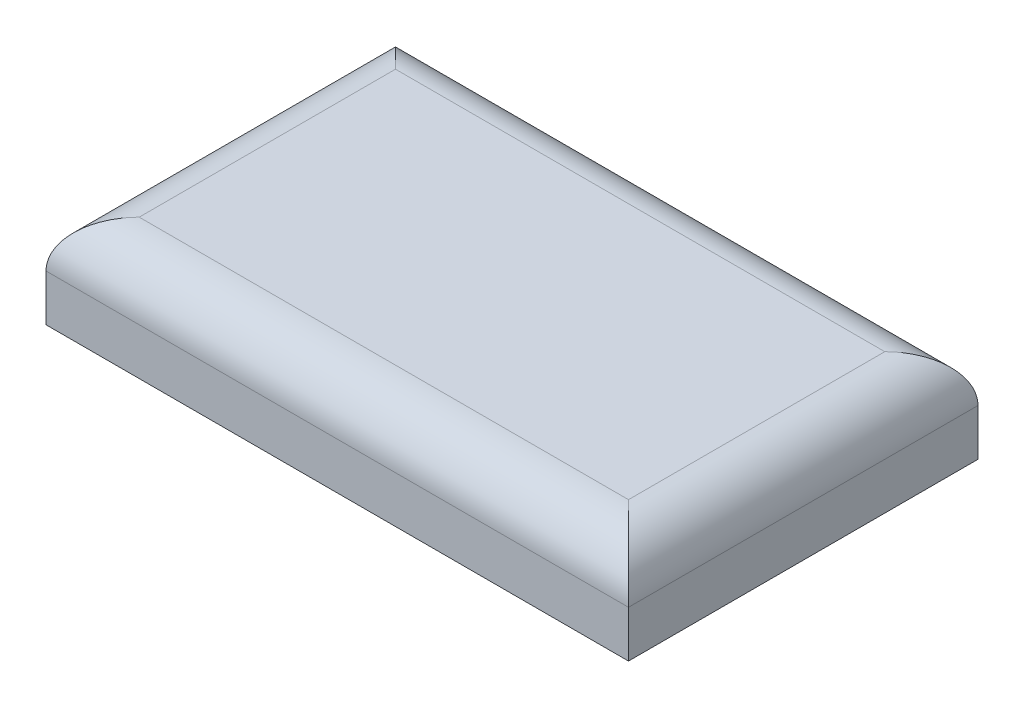
ISO-10303-21;
HEADER;
FILE_DESCRIPTION(('STEP AP214'),'2;1');
FILE_NAME('part.step','',(''),(''),'','','');
FILE_SCHEMA(('AUTOMOTIVE_DESIGN { 1 0 10303 214 1 1 1 1 }'));
ENDSEC;
DATA;
#1=APPLICATION_CONTEXT('core data for automotive mechanical design processes');
#2=APPLICATION_PROTOCOL_DEFINITION('international standard','automotive_design',2000,#1);
#3=PRODUCT_CONTEXT('',#1,'mechanical');
#4=PRODUCT('Part','Part','',(#3));
#5=PRODUCT_RELATED_PRODUCT_CATEGORY('part','',(#4));
#6=PRODUCT_DEFINITION_FORMATION('','',#4);
#7=PRODUCT_DEFINITION_CONTEXT('part definition',#1,'design');
#8=PRODUCT_DEFINITION('design','',#6,#7);
#9=PRODUCT_DEFINITION_SHAPE('','',#8);
#10=(LENGTH_UNIT() NAMED_UNIT(*) SI_UNIT(.MILLI.,.METRE.));
#11=(NAMED_UNIT(*) PLANE_ANGLE_UNIT() SI_UNIT($,.RADIAN.));
#12=(NAMED_UNIT(*) SI_UNIT($,.STERADIAN.) SOLID_ANGLE_UNIT());
#13=UNCERTAINTY_MEASURE_WITH_UNIT(LENGTH_MEASURE(1.E-05),#10,'distance_accuracy_value','');
#14=(GEOMETRIC_REPRESENTATION_CONTEXT(3) GLOBAL_UNCERTAINTY_ASSIGNED_CONTEXT((#13)) GLOBAL_UNIT_ASSIGNED_CONTEXT((#10,
#11,#12)) REPRESENTATION_CONTEXT('',''));
#15=CARTESIAN_POINT('',(0.,0.,0.));
#16=DIRECTION('',(0.,0.,1.));
#17=DIRECTION('',(1.,0.,0.));
#18=AXIS2_PLACEMENT_3D('',#15,#16,#17);
#19=CARTESIAN_POINT('',(-125.,40.0000000000002,75.0000000000002));
#20=DIRECTION('',(1.,0.,0.));
#21=DIRECTION('',(0.,0.,-1.));
#22=AXIS2_PLACEMENT_3D('',#19,#20,#21);
#23=PLANE('',#22);
#24=DIRECTION('',(0.,-1.,0.));
#25=VECTOR('',#24,1.);
#26=CARTESIAN_POINT('',(-125.,40.0000000000002,75.0000000000002));
#27=LINE('',#26,#25);
#28=CARTESIAN_POINT('',(-125.,20.0000000000001,74.9999999999997));
#29=VERTEX_POINT('',#28);
#30=CARTESIAN_POINT('',(-125.,1.38777878078145E-13,75.0000000000002));
#31=VERTEX_POINT('',#30);
#32=EDGE_CURVE('E86',#29,#31,#27,.T.);
#33=ORIENTED_EDGE('',*,*,#32,.F.);
#34=DIRECTION('',(0.,0.,1.));
#35=VECTOR('',#34,1.);
#36=CARTESIAN_POINT('',(-125.,19.9999999999999,-75.0000000000004));
#37=LINE('',#36,#35);
#38=CARTESIAN_POINT('',(-125.,19.9999999999999,-75.0000000000004));
#39=VERTEX_POINT('',#38);
#40=EDGE_CURVE('E43',#29,#39,#37,.F.);
#41=ORIENTED_EDGE('',*,*,#40,.T.);
#42=DIRECTION('',(0.,-1.,0.));
#43=VECTOR('',#42,1.);
#44=CARTESIAN_POINT('',(-125.,40.0000000000001,-75.0000000000008));
#45=LINE('',#44,#43);
#46=CARTESIAN_POINT('',(-125.,-1.94289029309402E-13,-75.));
#47=VERTEX_POINT('',#46);
#48=EDGE_CURVE('E103',#39,#47,#45,.T.);
#49=ORIENTED_EDGE('',*,*,#48,.T.);
#50=DIRECTION('',(0.,0.,1.));
#51=VECTOR('',#50,1.);
#52=CARTESIAN_POINT('',(-125.,1.38777878078145E-13,75.0000000000002));
#53=LINE('',#52,#51);
#54=EDGE_CURVE('E99',#47,#31,#53,.T.);
#55=ORIENTED_EDGE('',*,*,#54,.T.);
#56=EDGE_LOOP('',(#33,#41,#49,#55));
#57=FACE_BOUND('',#56,.T.);
#58=ADVANCED_FACE('F34',(#57),#23,.F.);
#59=CARTESIAN_POINT('',(125.,40.0000000000002,74.9999999999996));
#60=DIRECTION('',(0.,0.,-1.));
#61=DIRECTION('',(-1.,0.,0.));
#62=AXIS2_PLACEMENT_3D('',#59,#60,#61);
#63=PLANE('',#62);
#64=DIRECTION('',(0.,-1.,0.));
#65=VECTOR('',#64,1.);
#66=CARTESIAN_POINT('',(125.,40.0000000000002,74.9999999999996));
#67=LINE('',#66,#65);
#68=CARTESIAN_POINT('',(125.,20.,74.9999999999995));
#69=VERTEX_POINT('',#68);
#70=CARTESIAN_POINT('',(125.,0.,74.9999999999997));
#71=VERTEX_POINT('',#70);
#72=EDGE_CURVE('E93',#69,#71,#67,.T.);
#73=ORIENTED_EDGE('',*,*,#72,.F.);
#74=DIRECTION('',(1.,0.,0.));
#75=VECTOR('',#74,1.);
#76=CARTESIAN_POINT('',(-125.,20.0000000000001,74.9999999999997));
#77=LINE('',#76,#75);
#78=EDGE_CURVE('E58',#69,#29,#77,.F.);
#79=ORIENTED_EDGE('',*,*,#78,.T.);
#80=ORIENTED_EDGE('',*,*,#32,.T.);
#81=DIRECTION('',(1.,0.,0.));
#82=VECTOR('',#81,1.);
#83=CARTESIAN_POINT('',(125.,0.,74.9999999999997));
#84=LINE('',#83,#82);
#85=EDGE_CURVE('E89',#31,#71,#84,.T.);
#86=ORIENTED_EDGE('',*,*,#85,.T.);
#87=EDGE_LOOP('',(#73,#79,#80,#86));
#88=FACE_BOUND('',#87,.T.);
#89=ADVANCED_FACE('F88',(#88),#63,.F.);
#90=CARTESIAN_POINT('',(125.,40.0000000000002,74.9999999999996));
#91=DIRECTION('',(-1.,0.,0.));
#92=DIRECTION('',(0.,0.,1.));
#93=AXIS2_PLACEMENT_3D('',#90,#91,#92);
#94=PLANE('',#93);
#95=DIRECTION('',(0.,-1.,0.));
#96=VECTOR('',#95,1.);
#97=CARTESIAN_POINT('',(125.,40.0000000000003,-75.0000000000006));
#98=LINE('',#97,#96);
#99=CARTESIAN_POINT('',(125.,20.0000000000002,-75.0000000000011));
#100=VERTEX_POINT('',#99);
#101=CARTESIAN_POINT('',(125.,1.11022302462516E-13,-75.0000000000004));
#102=VERTEX_POINT('',#101);
#103=EDGE_CURVE('E113',#100,#102,#98,.T.);
#104=ORIENTED_EDGE('',*,*,#103,.F.);
#105=DIRECTION('',(0.,0.,-1.));
#106=VECTOR('',#105,1.);
#107=CARTESIAN_POINT('',(125.,20.,74.9999999999995));
#108=LINE('',#107,#106);
#109=EDGE_CURVE('E124',#100,#69,#108,.F.);
#110=ORIENTED_EDGE('',*,*,#109,.T.);
#111=ORIENTED_EDGE('',*,*,#72,.T.);
#112=DIRECTION('',(0.,0.,-1.));
#113=VECTOR('',#112,1.);
#114=CARTESIAN_POINT('',(125.,0.,74.9999999999997));
#115=LINE('',#114,#113);
#116=EDGE_CURVE('E101',#71,#102,#115,.T.);
#117=ORIENTED_EDGE('',*,*,#116,.T.);
#118=EDGE_LOOP('',(#104,#110,#111,#117));
#119=FACE_BOUND('',#118,.T.);
#120=ADVANCED_FACE('F152',(#119),#94,.F.);
#121=CARTESIAN_POINT('',(125.,40.0000000000003,-75.0000000000006));
#122=DIRECTION('',(0.,0.,1.));
#123=DIRECTION('',(1.,0.,0.));
#124=AXIS2_PLACEMENT_3D('',#121,#122,#123);
#125=PLANE('',#124);
#126=ORIENTED_EDGE('',*,*,#48,.F.);
#127=DIRECTION('',(-1.,0.,0.));
#128=VECTOR('',#127,1.);
#129=CARTESIAN_POINT('',(125.,20.0000000000002,-75.0000000000011));
#130=LINE('',#129,#128);
#131=EDGE_CURVE('E11',#39,#100,#130,.F.);
#132=ORIENTED_EDGE('',*,*,#131,.T.);
#133=ORIENTED_EDGE('',*,*,#103,.T.);
#134=DIRECTION('',(-1.,0.,0.));
#135=VECTOR('',#134,1.);
#136=CARTESIAN_POINT('',(125.,1.11022302462516E-13,-75.0000000000004));
#137=LINE('',#136,#135);
#138=EDGE_CURVE('E110',#102,#47,#137,.T.);
#139=ORIENTED_EDGE('',*,*,#138,.T.);
#140=EDGE_LOOP('',(#126,#132,#133,#139));
#141=FACE_BOUND('',#140,.T.);
#142=ADVANCED_FACE('F154',(#141),#125,.F.);
#143=CARTESIAN_POINT('',(0.,40.0000000000001,-4.44089209850063E-13));
#144=DIRECTION('',(0.,1.,0.));
#145=DIRECTION('',(0.,0.,1.));
#146=AXIS2_PLACEMENT_3D('',#143,#144,#145);
#147=PLANE('',#146);
#148=DIRECTION('',(1.,0.,0.));
#149=VECTOR('',#148,1.);
#150=CARTESIAN_POINT('',(125.,40.0000000000001,54.9999999999999));
#151=LINE('',#150,#149);
#152=CARTESIAN_POINT('',(-105.,40.,55.0000000000003));
#153=VERTEX_POINT('',#152);
#154=CARTESIAN_POINT('',(105.,40.,55.0000000000002));
#155=VERTEX_POINT('',#154);
#156=EDGE_CURVE('E119',#153,#155,#151,.T.);
#157=ORIENTED_EDGE('',*,*,#156,.T.);
#158=DIRECTION('',(0.,0.,-1.));
#159=VECTOR('',#158,1.);
#160=CARTESIAN_POINT('',(105.,40.0000000000003,-75.0000000000008));
#161=LINE('',#160,#159);
#162=CARTESIAN_POINT('',(105.,40.0000000000002,-55.0000000000006));
#163=VERTEX_POINT('',#162);
#164=EDGE_CURVE('E121',#155,#163,#161,.T.);
#165=ORIENTED_EDGE('',*,*,#164,.T.);
#166=DIRECTION('',(-1.,0.,0.));
#167=VECTOR('',#166,1.);
#168=CARTESIAN_POINT('',(-125.,40.,-55.0000000000004));
#169=LINE('',#168,#167);
#170=CARTESIAN_POINT('',(-105.,40.,-55.0000000000006));
#171=VERTEX_POINT('',#170);
#172=EDGE_CURVE('E92',#163,#171,#169,.T.);
#173=ORIENTED_EDGE('',*,*,#172,.T.);
#174=DIRECTION('',(0.,0.,1.));
#175=VECTOR('',#174,1.);
#176=CARTESIAN_POINT('',(-105.,40.0000000000002,75.0000000000006));
#177=LINE('',#176,#175);
#178=EDGE_CURVE('E117',#171,#153,#177,.T.);
#179=ORIENTED_EDGE('',*,*,#178,.T.);
#180=EDGE_LOOP('',(#157,#165,#173,#179));
#181=FACE_BOUND('',#180,.T.);
#182=ADVANCED_FACE('F144',(#181),#147,.T.);
#183=CARTESIAN_POINT('',(0.,0.,0.));
#184=DIRECTION('',(0.,1.,0.));
#185=DIRECTION('',(0.,0.,1.));
#186=AXIS2_PLACEMENT_3D('',#183,#184,#185);
#187=PLANE('',#186);
#188=ORIENTED_EDGE('',*,*,#54,.F.);
#189=ORIENTED_EDGE('',*,*,#138,.F.);
#190=ORIENTED_EDGE('',*,*,#116,.F.);
#191=ORIENTED_EDGE('',*,*,#85,.F.);
#192=EDGE_LOOP('',(#188,#189,#190,#191));
#193=FACE_BOUND('',#192,.T.);
#194=ADVANCED_FACE('F97',(#193),#187,.F.);
#195=CARTESIAN_POINT('',(-105.,19.9999999999999,2.22044604925031E-13));
#196=DIRECTION('',(0.,0.,-1.));
#197=DIRECTION('',(-1.,0.,0.));
#198=AXIS2_PLACEMENT_3D('',#195,#196,#197);
#199=CYLINDRICAL_SURFACE('',#198,20.);
#200=CARTESIAN_POINT('',(-105.,20.,-55.0000000000004));
#201=DIRECTION('',(0.707106781186547,0.,-0.70710678118655));
#202=DIRECTION('',(0.707106781186548,0.,0.707106781186551));
#203=AXIS2_PLACEMENT_3D('',#200,#201,#202);
#204=ELLIPSE('',#203,28.2842712474619,20.);
#205=EDGE_CURVE('E107',#39,#171,#204,.T.);
#206=ORIENTED_EDGE('',*,*,#205,.F.);
#207=ORIENTED_EDGE('',*,*,#40,.F.);
#208=CARTESIAN_POINT('',(-105.,20.0000000000001,55.));
#209=DIRECTION('',(-0.707106781186548,0.,-0.707106781186551));
#210=DIRECTION('',(0.707106781186547,0.,-0.70710678118655));
#211=AXIS2_PLACEMENT_3D('',#208,#209,#210);
#212=ELLIPSE('',#211,28.2842712474619,20.);
#213=EDGE_CURVE('E38',#153,#29,#212,.F.);
#214=ORIENTED_EDGE('',*,*,#213,.F.);
#215=ORIENTED_EDGE('',*,*,#178,.F.);
#216=EDGE_LOOP('',(#206,#207,#214,#215));
#217=FACE_BOUND('',#216,.T.);
#218=ADVANCED_FACE('F36',(#217),#199,.T.);
#219=CARTESIAN_POINT('',(0.,20.0000000000001,54.9999999999996));
#220=DIRECTION('',(-1.,0.,0.));
#221=DIRECTION('',(0.,0.,1.));
#222=AXIS2_PLACEMENT_3D('',#219,#220,#221);
#223=CYLINDRICAL_SURFACE('',#222,20.);
#224=ORIENTED_EDGE('',*,*,#213,.T.);
#225=ORIENTED_EDGE('',*,*,#78,.F.);
#226=CARTESIAN_POINT('',(105.,20.0000000000001,54.9999999999996));
#227=DIRECTION('',(-0.707106781186547,0.,0.70710678118655));
#228=DIRECTION('',(-0.707106781186548,0.,-0.707106781186551));
#229=AXIS2_PLACEMENT_3D('',#226,#227,#228);
#230=ELLIPSE('',#229,28.2842712474619,20.);
#231=EDGE_CURVE('E131',#155,#69,#230,.F.);
#232=ORIENTED_EDGE('',*,*,#231,.F.);
#233=ORIENTED_EDGE('',*,*,#156,.F.);
#234=EDGE_LOOP('',(#224,#225,#232,#233));
#235=FACE_BOUND('',#234,.T.);
#236=ADVANCED_FACE('F174',(#235),#223,.T.);
#237=CARTESIAN_POINT('',(0.,20.,-55.0000000000008));
#238=DIRECTION('',(1.,0.,0.));
#239=DIRECTION('',(0.,0.,-1.));
#240=AXIS2_PLACEMENT_3D('',#237,#238,#239);
#241=CYLINDRICAL_SURFACE('',#240,20.);
#242=ORIENTED_EDGE('',*,*,#205,.T.);
#243=ORIENTED_EDGE('',*,*,#172,.F.);
#244=CARTESIAN_POINT('',(105.,20.0000000000001,-55.0000000000008));
#245=DIRECTION('',(0.707106781186548,0.,0.707106781186551));
#246=DIRECTION('',(0.707106781186547,0.,-0.70710678118655));
#247=AXIS2_PLACEMENT_3D('',#244,#245,#246);
#248=ELLIPSE('',#247,28.2842712474619,20.);
#249=EDGE_CURVE('E129',#100,#163,#248,.T.);
#250=ORIENTED_EDGE('',*,*,#249,.F.);
#251=ORIENTED_EDGE('',*,*,#131,.F.);
#252=EDGE_LOOP('',(#242,#243,#250,#251));
#253=FACE_BOUND('',#252,.T.);
#254=ADVANCED_FACE('F137',(#253),#241,.T.);
#255=CARTESIAN_POINT('',(105.,20.0000000000002,-6.66133814775094E-13));
#256=DIRECTION('',(0.,0.,1.));
#257=DIRECTION('',(1.,0.,0.));
#258=AXIS2_PLACEMENT_3D('',#255,#256,#257);
#259=CYLINDRICAL_SURFACE('',#258,20.);
#260=ORIENTED_EDGE('',*,*,#231,.T.);
#261=ORIENTED_EDGE('',*,*,#109,.F.);
#262=ORIENTED_EDGE('',*,*,#249,.T.);
#263=ORIENTED_EDGE('',*,*,#164,.F.);
#264=EDGE_LOOP('',(#260,#261,#262,#263));
#265=FACE_BOUND('',#264,.T.);
#266=ADVANCED_FACE('F148',(#265),#259,.T.);
#267=CLOSED_SHELL('',(#58,#89,#120,#142,#182,#194,#218,#236,#254,#266));
#268=MANIFOLD_SOLID_BREP('B2',#267);
#269=ADVANCED_BREP_SHAPE_REPRESENTATION('',(#18,#268),#14);
#270=SHAPE_DEFINITION_REPRESENTATION(#9,#269);
ENDSEC;
END-ISO-10303-21;
